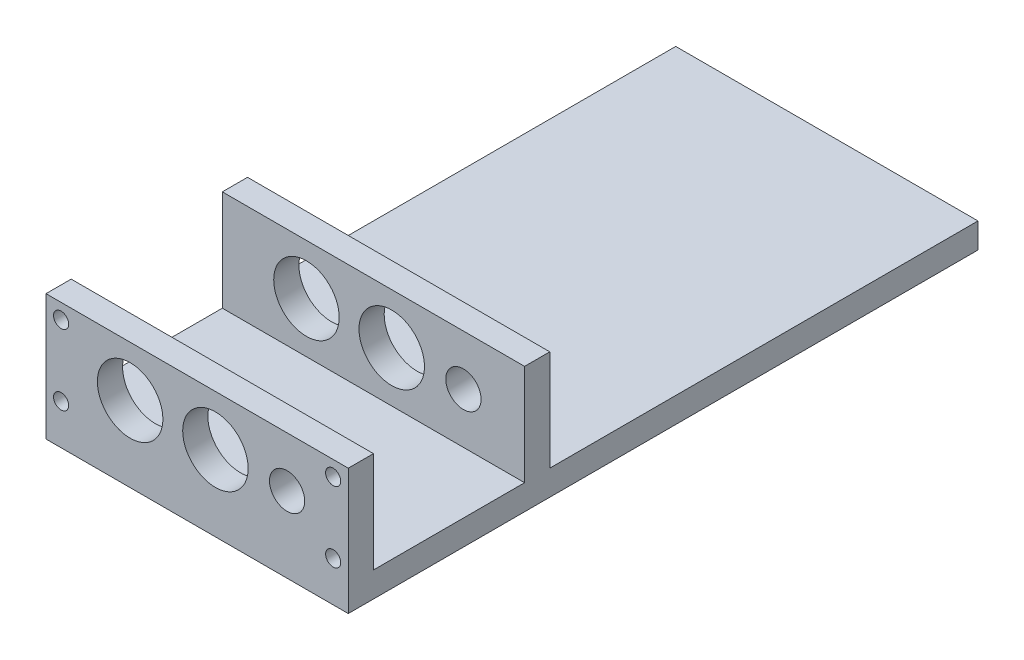
ISO-10303-21;
HEADER;
FILE_DESCRIPTION(('STEP AP214'),'2;1');
FILE_NAME('part.step','',(''),(''),'','','');
FILE_SCHEMA(('AUTOMOTIVE_DESIGN { 1 0 10303 214 1 1 1 1 }'));
ENDSEC;
DATA;
#1=APPLICATION_CONTEXT('core data for automotive mechanical design processes');
#2=APPLICATION_PROTOCOL_DEFINITION('international standard','automotive_design',2000,#1);
#3=PRODUCT_CONTEXT('',#1,'mechanical');
#4=PRODUCT('Part','Part','',(#3));
#5=PRODUCT_RELATED_PRODUCT_CATEGORY('part','',(#4));
#6=PRODUCT_DEFINITION_FORMATION('','',#4);
#7=PRODUCT_DEFINITION_CONTEXT('part definition',#1,'design');
#8=PRODUCT_DEFINITION('design','',#6,#7);
#9=PRODUCT_DEFINITION_SHAPE('','',#8);
#10=(LENGTH_UNIT() NAMED_UNIT(*) SI_UNIT(.MILLI.,.METRE.));
#11=(NAMED_UNIT(*) PLANE_ANGLE_UNIT() SI_UNIT($,.RADIAN.));
#12=(NAMED_UNIT(*) SI_UNIT($,.STERADIAN.) SOLID_ANGLE_UNIT());
#13=UNCERTAINTY_MEASURE_WITH_UNIT(LENGTH_MEASURE(1.E-05),#10,'distance_accuracy_value','');
#14=(GEOMETRIC_REPRESENTATION_CONTEXT(3) GLOBAL_UNCERTAINTY_ASSIGNED_CONTEXT((#13)) GLOBAL_UNIT_ASSIGNED_CONTEXT((#10,
#11,#12)) REPRESENTATION_CONTEXT('',''));
#15=CARTESIAN_POINT('',(0.,0.,0.));
#16=DIRECTION('',(0.,0.,1.));
#17=DIRECTION('',(1.,0.,0.));
#18=AXIS2_PLACEMENT_3D('',#15,#16,#17);
#19=CARTESIAN_POINT('',(60.,5.,-120.));
#20=DIRECTION('',(0.,-1.,0.));
#21=DIRECTION('',(0.,0.,-1.));
#22=AXIS2_PLACEMENT_3D('',#19,#20,#21);
#23=PLANE('',#22);
#24=DIRECTION('',(-1.,0.,0.));
#25=VECTOR('',#24,1.);
#26=CARTESIAN_POINT('',(60.,5.,-35.));
#27=LINE('',#26,#25);
#28=CARTESIAN_POINT('',(60.,5.,-35.));
#29=VERTEX_POINT('',#28);
#30=CARTESIAN_POINT('',(0.,5.,-35.));
#31=VERTEX_POINT('',#30);
#32=EDGE_CURVE('E230',#29,#31,#27,.T.);
#33=ORIENTED_EDGE('',*,*,#32,.F.);
#34=DIRECTION('',(0.,0.,1.));
#35=VECTOR('',#34,1.);
#36=CARTESIAN_POINT('',(60.,5.,-120.));
#37=LINE('',#36,#35);
#38=CARTESIAN_POINT('',(60.,5.,-120.));
#39=VERTEX_POINT('',#38);
#40=EDGE_CURVE('E138',#39,#29,#37,.T.);
#41=ORIENTED_EDGE('',*,*,#40,.F.);
#42=DIRECTION('',(1.,0.,0.));
#43=VECTOR('',#42,1.);
#44=CARTESIAN_POINT('',(60.,5.,-120.));
#45=LINE('',#44,#43);
#46=CARTESIAN_POINT('',(0.,5.,-120.));
#47=VERTEX_POINT('',#46);
#48=EDGE_CURVE('E155',#47,#39,#45,.T.);
#49=ORIENTED_EDGE('',*,*,#48,.F.);
#50=DIRECTION('',(0.,0.,1.));
#51=VECTOR('',#50,1.);
#52=CARTESIAN_POINT('',(0.,5.,-120.));
#53=LINE('',#52,#51);
#54=EDGE_CURVE('E60',#47,#31,#53,.T.);
#55=ORIENTED_EDGE('',*,*,#54,.T.);
#56=EDGE_LOOP('',(#33,#41,#49,#55));
#57=FACE_BOUND('',#56,.T.);
#58=ADVANCED_FACE('F35',(#57),#23,.F.);
#59=DIRECTION('',(1.,0.,0.));
#60=VECTOR('',#59,1.);
#61=CARTESIAN_POINT('',(0.,5.,-30.));
#62=LINE('',#61,#60);
#63=CARTESIAN_POINT('',(0.,5.,-30.));
#64=VERTEX_POINT('',#63);
#65=CARTESIAN_POINT('',(60.,5.,-30.));
#66=VERTEX_POINT('',#65);
#67=EDGE_CURVE('E52',#64,#66,#62,.T.);
#68=ORIENTED_EDGE('',*,*,#67,.F.);
#69=CARTESIAN_POINT('',(0.,5.,0.));
#70=VERTEX_POINT('',#69);
#71=EDGE_CURVE('E159',#64,#70,#53,.T.);
#72=ORIENTED_EDGE('',*,*,#71,.T.);
#73=DIRECTION('',(1.,0.,0.));
#74=VECTOR('',#73,1.);
#75=CARTESIAN_POINT('',(60.,5.,0.));
#76=LINE('',#75,#74);
#77=CARTESIAN_POINT('',(60.,5.,0.));
#78=VERTEX_POINT('',#77);
#79=EDGE_CURVE('E139',#70,#78,#76,.T.);
#80=ORIENTED_EDGE('',*,*,#79,.T.);
#81=EDGE_CURVE('E156',#66,#78,#37,.T.);
#82=ORIENTED_EDGE('',*,*,#81,.F.);
#83=EDGE_LOOP('',(#68,#72,#80,#82));
#84=FACE_BOUND('',#83,.T.);
#85=ADVANCED_FACE('F244',(#84),#23,.F.);
#86=CARTESIAN_POINT('',(0.,0.,5.));
#87=DIRECTION('',(1.,0.,0.));
#88=DIRECTION('',(0.,0.,-1.));
#89=AXIS2_PLACEMENT_3D('',#86,#87,#88);
#90=PLANE('',#89);
#91=DIRECTION('',(0.,-1.,0.));
#92=VECTOR('',#91,1.);
#93=CARTESIAN_POINT('',(0.,0.,0.));
#94=LINE('',#93,#92);
#95=CARTESIAN_POINT('',(0.,25.,0.));
#96=VERTEX_POINT('',#95);
#97=EDGE_CURVE('E161',#96,#70,#94,.T.);
#98=ORIENTED_EDGE('',*,*,#97,.T.);
#99=ORIENTED_EDGE('',*,*,#71,.F.);
#100=DIRECTION('',(0.,-1.,0.));
#101=VECTOR('',#100,1.);
#102=CARTESIAN_POINT('',(0.,25.,-30.));
#103=LINE('',#102,#101);
#104=CARTESIAN_POINT('',(0.,25.,-30.));
#105=VERTEX_POINT('',#104);
#106=EDGE_CURVE('E144',#105,#64,#103,.T.);
#107=ORIENTED_EDGE('',*,*,#106,.F.);
#108=DIRECTION('',(0.,0.,1.));
#109=VECTOR('',#108,1.);
#110=CARTESIAN_POINT('',(0.,25.,-35.));
#111=LINE('',#110,#109);
#112=CARTESIAN_POINT('',(0.,25.,-35.));
#113=VERTEX_POINT('',#112);
#114=EDGE_CURVE('E123',#113,#105,#111,.T.);
#115=ORIENTED_EDGE('',*,*,#114,.F.);
#116=DIRECTION('',(0.,-1.,0.));
#117=VECTOR('',#116,1.);
#118=CARTESIAN_POINT('',(0.,25.,-35.));
#119=LINE('',#118,#117);
#120=EDGE_CURVE('E120',#113,#31,#119,.T.);
#121=ORIENTED_EDGE('',*,*,#120,.T.);
#122=ORIENTED_EDGE('',*,*,#54,.F.);
#123=DIRECTION('',(0.,1.,0.));
#124=VECTOR('',#123,1.);
#125=CARTESIAN_POINT('',(0.,5.,-120.));
#126=LINE('',#125,#124);
#127=CARTESIAN_POINT('',(0.,0.,-120.));
#128=VERTEX_POINT('',#127);
#129=EDGE_CURVE('E153',#128,#47,#126,.T.);
#130=ORIENTED_EDGE('',*,*,#129,.F.);
#131=DIRECTION('',(0.,0.,-1.));
#132=VECTOR('',#131,1.);
#133=CARTESIAN_POINT('',(0.,0.,5.));
#134=LINE('',#133,#132);
#135=CARTESIAN_POINT('',(0.,0.,5.));
#136=VERTEX_POINT('',#135);
#137=EDGE_CURVE('E11',#136,#128,#134,.T.);
#138=ORIENTED_EDGE('',*,*,#137,.F.);
#139=DIRECTION('',(0.,-1.,0.));
#140=VECTOR('',#139,1.);
#141=CARTESIAN_POINT('',(0.,0.,5.));
#142=LINE('',#141,#140);
#143=CARTESIAN_POINT('',(0.,25.,5.));
#144=VERTEX_POINT('',#143);
#145=EDGE_CURVE('E162',#144,#136,#142,.T.);
#146=ORIENTED_EDGE('',*,*,#145,.F.);
#147=DIRECTION('',(0.,0.,-1.));
#148=VECTOR('',#147,1.);
#149=CARTESIAN_POINT('',(0.,25.,5.));
#150=LINE('',#149,#148);
#151=EDGE_CURVE('E172',#144,#96,#150,.T.);
#152=ORIENTED_EDGE('',*,*,#151,.T.);
#153=EDGE_LOOP('',(#98,#99,#107,#115,#121,#122,#130,#138,#146,#152));
#154=FACE_BOUND('',#153,.T.);
#155=ADVANCED_FACE('F37',(#154),#90,.F.);
#156=CARTESIAN_POINT('',(0.,0.,5.));
#157=DIRECTION('',(0.,1.,0.));
#158=DIRECTION('',(0.,0.,1.));
#159=AXIS2_PLACEMENT_3D('',#156,#157,#158);
#160=PLANE('',#159);
#161=ORIENTED_EDGE('',*,*,#137,.T.);
#162=DIRECTION('',(-1.,0.,0.));
#163=VECTOR('',#162,1.);
#164=CARTESIAN_POINT('',(60.,0.,-120.));
#165=LINE('',#164,#163);
#166=CARTESIAN_POINT('',(60.,0.,-120.));
#167=VERTEX_POINT('',#166);
#168=EDGE_CURVE('E150',#167,#128,#165,.T.);
#169=ORIENTED_EDGE('',*,*,#168,.F.);
#170=DIRECTION('',(0.,0.,-1.));
#171=VECTOR('',#170,1.);
#172=CARTESIAN_POINT('',(60.,0.,5.));
#173=LINE('',#172,#171);
#174=CARTESIAN_POINT('',(60.,0.,5.));
#175=VERTEX_POINT('',#174);
#176=EDGE_CURVE('E44',#175,#167,#173,.T.);
#177=ORIENTED_EDGE('',*,*,#176,.F.);
#178=DIRECTION('',(1.,0.,0.));
#179=VECTOR('',#178,1.);
#180=CARTESIAN_POINT('',(0.,0.,5.));
#181=LINE('',#180,#179);
#182=EDGE_CURVE('E165',#136,#175,#181,.T.);
#183=ORIENTED_EDGE('',*,*,#182,.F.);
#184=EDGE_LOOP('',(#161,#169,#177,#183));
#185=FACE_BOUND('',#184,.T.);
#186=ADVANCED_FACE('F262',(#185),#160,.F.);
#187=CARTESIAN_POINT('',(60.,0.,5.));
#188=DIRECTION('',(-1.,0.,0.));
#189=DIRECTION('',(0.,0.,1.));
#190=AXIS2_PLACEMENT_3D('',#187,#188,#189);
#191=PLANE('',#190);
#192=ORIENTED_EDGE('',*,*,#176,.T.);
#193=DIRECTION('',(0.,-1.,0.));
#194=VECTOR('',#193,1.);
#195=CARTESIAN_POINT('',(60.,5.,-120.));
#196=LINE('',#195,#194);
#197=EDGE_CURVE('E142',#39,#167,#196,.T.);
#198=ORIENTED_EDGE('',*,*,#197,.F.);
#199=ORIENTED_EDGE('',*,*,#40,.T.);
#200=DIRECTION('',(0.,-1.,0.));
#201=VECTOR('',#200,1.);
#202=CARTESIAN_POINT('',(60.,25.,-35.));
#203=LINE('',#202,#201);
#204=CARTESIAN_POINT('',(60.,25.,-35.));
#205=VERTEX_POINT('',#204);
#206=EDGE_CURVE('E118',#205,#29,#203,.T.);
#207=ORIENTED_EDGE('',*,*,#206,.F.);
#208=DIRECTION('',(0.,0.,-1.));
#209=VECTOR('',#208,1.);
#210=CARTESIAN_POINT('',(60.,25.,-30.));
#211=LINE('',#210,#209);
#212=CARTESIAN_POINT('',(60.,25.,-30.));
#213=VERTEX_POINT('',#212);
#214=EDGE_CURVE('E124',#213,#205,#211,.T.);
#215=ORIENTED_EDGE('',*,*,#214,.F.);
#216=DIRECTION('',(0.,-1.,0.));
#217=VECTOR('',#216,1.);
#218=CARTESIAN_POINT('',(60.,25.,-30.));
#219=LINE('',#218,#217);
#220=EDGE_CURVE('E234',#213,#66,#219,.T.);
#221=ORIENTED_EDGE('',*,*,#220,.T.);
#222=ORIENTED_EDGE('',*,*,#81,.T.);
#223=DIRECTION('',(0.,1.,0.));
#224=VECTOR('',#223,1.);
#225=CARTESIAN_POINT('',(60.,0.,0.));
#226=LINE('',#225,#224);
#227=CARTESIAN_POINT('',(60.,25.,0.));
#228=VERTEX_POINT('',#227);
#229=EDGE_CURVE('E175',#78,#228,#226,.T.);
#230=ORIENTED_EDGE('',*,*,#229,.T.);
#231=DIRECTION('',(0.,0.,-1.));
#232=VECTOR('',#231,1.);
#233=CARTESIAN_POINT('',(60.,25.,5.));
#234=LINE('',#233,#232);
#235=CARTESIAN_POINT('',(60.,25.,5.));
#236=VERTEX_POINT('',#235);
#237=EDGE_CURVE('E180',#236,#228,#234,.T.);
#238=ORIENTED_EDGE('',*,*,#237,.F.);
#239=DIRECTION('',(0.,1.,0.));
#240=VECTOR('',#239,1.);
#241=CARTESIAN_POINT('',(60.,0.,5.));
#242=LINE('',#241,#240);
#243=EDGE_CURVE('E168',#175,#236,#242,.T.);
#244=ORIENTED_EDGE('',*,*,#243,.F.);
#245=EDGE_LOOP('',(#192,#198,#199,#207,#215,#221,#222,#230,#238,#244));
#246=FACE_BOUND('',#245,.T.);
#247=ADVANCED_FACE('F135',(#246),#191,.F.);
#248=CARTESIAN_POINT('',(0.,25.,5.));
#249=DIRECTION('',(0.,-1.,0.));
#250=DIRECTION('',(0.,0.,-1.));
#251=AXIS2_PLACEMENT_3D('',#248,#249,#250);
#252=PLANE('',#251);
#253=DIRECTION('',(-1.,0.,0.));
#254=VECTOR('',#253,1.);
#255=CARTESIAN_POINT('',(0.,25.,0.));
#256=LINE('',#255,#254);
#257=EDGE_CURVE('E166',#228,#96,#256,.T.);
#258=ORIENTED_EDGE('',*,*,#257,.T.);
#259=ORIENTED_EDGE('',*,*,#151,.F.);
#260=DIRECTION('',(-1.,0.,0.));
#261=VECTOR('',#260,1.);
#262=CARTESIAN_POINT('',(0.,25.,5.));
#263=LINE('',#262,#261);
#264=EDGE_CURVE('E170',#236,#144,#263,.T.);
#265=ORIENTED_EDGE('',*,*,#264,.F.);
#266=ORIENTED_EDGE('',*,*,#237,.T.);
#267=EDGE_LOOP('',(#258,#259,#265,#266));
#268=FACE_BOUND('',#267,.T.);
#269=ADVANCED_FACE('F253',(#268),#252,.F.);
#270=CARTESIAN_POINT('',(0.,0.,5.));
#271=DIRECTION('',(0.,0.,-1.));
#272=DIRECTION('',(-1.,0.,0.));
#273=AXIS2_PLACEMENT_3D('',#270,#271,#272);
#274=PLANE('',#273);
#275=CARTESIAN_POINT('',(47.8557825484138,15.,5.));
#276=DIRECTION('',(0.,0.,-1.));
#277=DIRECTION('',(-1.,0.,0.));
#278=AXIS2_PLACEMENT_3D('',#275,#276,#277);
#279=CIRCLE('',#278,3.5);
#280=CARTESIAN_POINT('',(44.3557825484138,15.,5.));
#281=VERTEX_POINT('',#280);
#282=EDGE_CURVE('E515',#281,#281,#279,.T.);
#283=ORIENTED_EDGE('',*,*,#282,.T.);
#284=EDGE_LOOP('',(#283));
#285=FACE_BOUND('',#284,.T.);
#286=CARTESIAN_POINT('',(33.6293932202949,15.,5.));
#287=DIRECTION('',(0.,0.,-1.));
#288=DIRECTION('',(-1.,0.,0.));
#289=AXIS2_PLACEMENT_3D('',#286,#287,#288);
#290=CIRCLE('',#289,6.5);
#291=CARTESIAN_POINT('',(27.1293932202949,15.,5.));
#292=VERTEX_POINT('',#291);
#293=EDGE_CURVE('E187',#292,#292,#290,.T.);
#294=ORIENTED_EDGE('',*,*,#293,.T.);
#295=EDGE_LOOP('',(#294));
#296=FACE_BOUND('',#295,.T.);
#297=CARTESIAN_POINT('',(16.6993728410354,15.,5.));
#298=DIRECTION('',(0.,0.,-1.));
#299=DIRECTION('',(-1.,0.,0.));
#300=AXIS2_PLACEMENT_3D('',#297,#298,#299);
#301=CIRCLE('',#300,6.5);
#302=CARTESIAN_POINT('',(10.1993728410354,15.,5.));
#303=VERTEX_POINT('',#302);
#304=EDGE_CURVE('E505',#303,#303,#301,.T.);
#305=ORIENTED_EDGE('',*,*,#304,.T.);
#306=EDGE_LOOP('',(#305));
#307=FACE_BOUND('',#306,.T.);
#308=CARTESIAN_POINT('',(57.,8.,5.));
#309=DIRECTION('',(0.,0.,-1.));
#310=DIRECTION('',(-1.,0.,0.));
#311=AXIS2_PLACEMENT_3D('',#308,#309,#310);
#312=CIRCLE('',#311,1.5);
#313=CARTESIAN_POINT('',(55.5,8.,5.));
#314=VERTEX_POINT('',#313);
#315=EDGE_CURVE('E228',#314,#314,#312,.T.);
#316=ORIENTED_EDGE('',*,*,#315,.T.);
#317=EDGE_LOOP('',(#316));
#318=FACE_BOUND('',#317,.T.);
#319=CARTESIAN_POINT('',(3.,22.,5.));
#320=DIRECTION('',(0.,0.,-1.));
#321=DIRECTION('',(-1.,0.,0.));
#322=AXIS2_PLACEMENT_3D('',#319,#320,#321);
#323=CIRCLE('',#322,1.5);
#324=CARTESIAN_POINT('',(1.50000000000001,22.,5.));
#325=VERTEX_POINT('',#324);
#326=EDGE_CURVE('E225',#325,#325,#323,.T.);
#327=ORIENTED_EDGE('',*,*,#326,.T.);
#328=EDGE_LOOP('',(#327));
#329=FACE_BOUND('',#328,.T.);
#330=CARTESIAN_POINT('',(3.,8.,5.));
#331=DIRECTION('',(0.,0.,-1.));
#332=DIRECTION('',(-1.,0.,0.));
#333=AXIS2_PLACEMENT_3D('',#330,#331,#332);
#334=CIRCLE('',#333,1.5);
#335=CARTESIAN_POINT('',(1.50000000000001,8.,5.));
#336=VERTEX_POINT('',#335);
#337=EDGE_CURVE('E222',#336,#336,#334,.T.);
#338=ORIENTED_EDGE('',*,*,#337,.T.);
#339=EDGE_LOOP('',(#338));
#340=FACE_BOUND('',#339,.T.);
#341=CARTESIAN_POINT('',(57.,22.,5.));
#342=DIRECTION('',(0.,0.,-1.));
#343=DIRECTION('',(-1.,0.,0.));
#344=AXIS2_PLACEMENT_3D('',#341,#342,#343);
#345=CIRCLE('',#344,1.5);
#346=CARTESIAN_POINT('',(55.5,22.,5.));
#347=VERTEX_POINT('',#346);
#348=EDGE_CURVE('E219',#347,#347,#345,.T.);
#349=ORIENTED_EDGE('',*,*,#348,.T.);
#350=EDGE_LOOP('',(#349));
#351=FACE_BOUND('',#350,.T.);
#352=ORIENTED_EDGE('',*,*,#145,.T.);
#353=ORIENTED_EDGE('',*,*,#182,.T.);
#354=ORIENTED_EDGE('',*,*,#243,.T.);
#355=ORIENTED_EDGE('',*,*,#264,.T.);
#356=EDGE_LOOP('',(#352,#353,#354,#355));
#357=FACE_BOUND('',#356,.T.);
#358=ADVANCED_FACE('F257',(#285,#296,#307,#318,#329,#340,#351,#357),#274,.F.);
#359=CARTESIAN_POINT('',(0.,0.,0.));
#360=DIRECTION('',(0.,0.,-1.));
#361=DIRECTION('',(-1.,0.,0.));
#362=AXIS2_PLACEMENT_3D('',#359,#360,#361);
#363=PLANE('',#362);
#364=CARTESIAN_POINT('',(47.8557825484138,15.,0.));
#365=DIRECTION('',(0.,0.,-1.));
#366=DIRECTION('',(-1.,0.,0.));
#367=AXIS2_PLACEMENT_3D('',#364,#365,#366);
#368=CIRCLE('',#367,3.5);
#369=CARTESIAN_POINT('',(44.3557825484138,15.,0.));
#370=VERTEX_POINT('',#369);
#371=EDGE_CURVE('E507',#370,#370,#368,.T.);
#372=ORIENTED_EDGE('',*,*,#371,.F.);
#373=EDGE_LOOP('',(#372));
#374=FACE_BOUND('',#373,.T.);
#375=CARTESIAN_POINT('',(33.6293932202949,15.,0.));
#376=DIRECTION('',(0.,0.,-1.));
#377=DIRECTION('',(-1.,0.,0.));
#378=AXIS2_PLACEMENT_3D('',#375,#376,#377);
#379=CIRCLE('',#378,6.5);
#380=CARTESIAN_POINT('',(27.1293932202949,15.,0.));
#381=VERTEX_POINT('',#380);
#382=EDGE_CURVE('E195',#381,#381,#379,.T.);
#383=ORIENTED_EDGE('',*,*,#382,.F.);
#384=EDGE_LOOP('',(#383));
#385=FACE_BOUND('',#384,.T.);
#386=CARTESIAN_POINT('',(16.6993728410354,15.,0.));
#387=DIRECTION('',(0.,0.,-1.));
#388=DIRECTION('',(-1.,0.,0.));
#389=AXIS2_PLACEMENT_3D('',#386,#387,#388);
#390=CIRCLE('',#389,6.5);
#391=CARTESIAN_POINT('',(10.1993728410354,15.,0.));
#392=VERTEX_POINT('',#391);
#393=EDGE_CURVE('E191',#392,#392,#390,.T.);
#394=ORIENTED_EDGE('',*,*,#393,.F.);
#395=EDGE_LOOP('',(#394));
#396=FACE_BOUND('',#395,.T.);
#397=CARTESIAN_POINT('',(57.,8.,0.));
#398=DIRECTION('',(0.,0.,-1.));
#399=DIRECTION('',(1.,0.,0.));
#400=AXIS2_PLACEMENT_3D('',#397,#398,#399);
#401=CIRCLE('',#400,1.5);
#402=CARTESIAN_POINT('',(58.5,8.,0.));
#403=VERTEX_POINT('',#402);
#404=EDGE_CURVE('E211',#403,#403,#401,.T.);
#405=ORIENTED_EDGE('',*,*,#404,.F.);
#406=EDGE_LOOP('',(#405));
#407=FACE_BOUND('',#406,.T.);
#408=CARTESIAN_POINT('',(3.,22.,0.));
#409=DIRECTION('',(0.,0.,-1.));
#410=DIRECTION('',(1.,0.,0.));
#411=AXIS2_PLACEMENT_3D('',#408,#409,#410);
#412=CIRCLE('',#411,1.5);
#413=CARTESIAN_POINT('',(4.5,22.,0.));
#414=VERTEX_POINT('',#413);
#415=EDGE_CURVE('E210',#414,#414,#412,.T.);
#416=ORIENTED_EDGE('',*,*,#415,.F.);
#417=EDGE_LOOP('',(#416));
#418=FACE_BOUND('',#417,.T.);
#419=CARTESIAN_POINT('',(3.,8.,0.));
#420=DIRECTION('',(0.,0.,-1.));
#421=DIRECTION('',(-1.,0.,0.));
#422=AXIS2_PLACEMENT_3D('',#419,#420,#421);
#423=CIRCLE('',#422,1.5);
#424=CARTESIAN_POINT('',(1.50000000000001,8.,0.));
#425=VERTEX_POINT('',#424);
#426=EDGE_CURVE('E207',#425,#425,#423,.T.);
#427=ORIENTED_EDGE('',*,*,#426,.F.);
#428=EDGE_LOOP('',(#427));
#429=FACE_BOUND('',#428,.T.);
#430=CARTESIAN_POINT('',(57.,22.,0.));
#431=DIRECTION('',(0.,0.,-1.));
#432=DIRECTION('',(-1.,0.,0.));
#433=AXIS2_PLACEMENT_3D('',#430,#431,#432);
#434=CIRCLE('',#433,1.5);
#435=CARTESIAN_POINT('',(55.5,22.,0.));
#436=VERTEX_POINT('',#435);
#437=EDGE_CURVE('E214',#436,#436,#434,.T.);
#438=ORIENTED_EDGE('',*,*,#437,.F.);
#439=EDGE_LOOP('',(#438));
#440=FACE_BOUND('',#439,.T.);
#441=ORIENTED_EDGE('',*,*,#79,.F.);
#442=ORIENTED_EDGE('',*,*,#97,.F.);
#443=ORIENTED_EDGE('',*,*,#257,.F.);
#444=ORIENTED_EDGE('',*,*,#229,.F.);
#445=EDGE_LOOP('',(#441,#442,#443,#444));
#446=FACE_BOUND('',#445,.T.);
#447=ADVANCED_FACE('F247',(#374,#385,#396,#407,#418,#429,#440,#446),#363,.T.);
#448=CARTESIAN_POINT('',(0.,0.,-120.));
#449=DIRECTION('',(0.,0.,-1.));
#450=DIRECTION('',(-1.,0.,0.));
#451=AXIS2_PLACEMENT_3D('',#448,#449,#450);
#452=PLANE('',#451);
#453=ORIENTED_EDGE('',*,*,#197,.T.);
#454=ORIENTED_EDGE('',*,*,#168,.T.);
#455=ORIENTED_EDGE('',*,*,#129,.T.);
#456=ORIENTED_EDGE('',*,*,#48,.T.);
#457=EDGE_LOOP('',(#453,#454,#455,#456));
#458=FACE_BOUND('',#457,.T.);
#459=ADVANCED_FACE('F265',(#458),#452,.T.);
#460=CARTESIAN_POINT('',(60.,25.,-35.));
#461=DIRECTION('',(0.,0.,1.));
#462=DIRECTION('',(1.,0.,0.));
#463=AXIS2_PLACEMENT_3D('',#460,#461,#462);
#464=PLANE('',#463);
#465=CARTESIAN_POINT('',(47.8557825484138,15.,-35.));
#466=DIRECTION('',(0.,0.,1.));
#467=DIRECTION('',(1.,0.,0.));
#468=AXIS2_PLACEMENT_3D('',#465,#466,#467);
#469=CIRCLE('',#468,3.5);
#470=CARTESIAN_POINT('',(51.3557825484138,15.,-35.));
#471=VERTEX_POINT('',#470);
#472=EDGE_CURVE('E510',#471,#471,#469,.T.);
#473=ORIENTED_EDGE('',*,*,#472,.T.);
#474=EDGE_LOOP('',(#473));
#475=FACE_BOUND('',#474,.T.);
#476=CARTESIAN_POINT('',(33.6293932202949,15.,-35.));
#477=DIRECTION('',(0.,0.,1.));
#478=DIRECTION('',(1.,0.,0.));
#479=AXIS2_PLACEMENT_3D('',#476,#477,#478);
#480=CIRCLE('',#479,6.5);
#481=CARTESIAN_POINT('',(40.1293932202949,15.,-35.));
#482=VERTEX_POINT('',#481);
#483=EDGE_CURVE('E190',#482,#482,#480,.T.);
#484=ORIENTED_EDGE('',*,*,#483,.T.);
#485=EDGE_LOOP('',(#484));
#486=FACE_BOUND('',#485,.T.);
#487=CARTESIAN_POINT('',(16.6993728410354,15.,-35.));
#488=DIRECTION('',(0.,0.,1.));
#489=DIRECTION('',(1.,0.,0.));
#490=AXIS2_PLACEMENT_3D('',#487,#488,#489);
#491=CIRCLE('',#490,6.5);
#492=CARTESIAN_POINT('',(23.1993728410354,15.,-35.));
#493=VERTEX_POINT('',#492);
#494=EDGE_CURVE('E186',#493,#493,#491,.T.);
#495=ORIENTED_EDGE('',*,*,#494,.T.);
#496=EDGE_LOOP('',(#495));
#497=FACE_BOUND('',#496,.T.);
#498=ORIENTED_EDGE('',*,*,#32,.T.);
#499=ORIENTED_EDGE('',*,*,#120,.F.);
#500=DIRECTION('',(-1.,0.,0.));
#501=VECTOR('',#500,1.);
#502=CARTESIAN_POINT('',(60.,25.,-35.));
#503=LINE('',#502,#501);
#504=EDGE_CURVE('E114',#205,#113,#503,.T.);
#505=ORIENTED_EDGE('',*,*,#504,.F.);
#506=ORIENTED_EDGE('',*,*,#206,.T.);
#507=EDGE_LOOP('',(#498,#499,#505,#506));
#508=FACE_BOUND('',#507,.T.);
#509=ADVANCED_FACE('F116',(#475,#486,#497,#508),#464,.F.);
#510=CARTESIAN_POINT('',(0.,25.,-30.));
#511=DIRECTION('',(0.,0.,-1.));
#512=DIRECTION('',(-1.,0.,0.));
#513=AXIS2_PLACEMENT_3D('',#510,#511,#512);
#514=PLANE('',#513);
#515=CARTESIAN_POINT('',(47.8557825484138,15.,-30.));
#516=DIRECTION('',(0.,0.,-1.));
#517=DIRECTION('',(-1.,0.,0.));
#518=AXIS2_PLACEMENT_3D('',#515,#516,#517);
#519=CIRCLE('',#518,3.5);
#520=CARTESIAN_POINT('',(44.3557825484138,15.,-30.));
#521=VERTEX_POINT('',#520);
#522=EDGE_CURVE('E39',#521,#521,#519,.T.);
#523=ORIENTED_EDGE('',*,*,#522,.T.);
#524=EDGE_LOOP('',(#523));
#525=FACE_BOUND('',#524,.T.);
#526=CARTESIAN_POINT('',(33.6293932202949,15.,-30.));
#527=DIRECTION('',(0.,0.,-1.));
#528=DIRECTION('',(-1.,0.,0.));
#529=AXIS2_PLACEMENT_3D('',#526,#527,#528);
#530=CIRCLE('',#529,6.5);
#531=CARTESIAN_POINT('',(27.1293932202949,15.,-30.));
#532=VERTEX_POINT('',#531);
#533=EDGE_CURVE('E188',#532,#532,#530,.T.);
#534=ORIENTED_EDGE('',*,*,#533,.T.);
#535=EDGE_LOOP('',(#534));
#536=FACE_BOUND('',#535,.T.);
#537=CARTESIAN_POINT('',(16.6993728410354,15.,-30.));
#538=DIRECTION('',(0.,0.,-1.));
#539=DIRECTION('',(-1.,0.,0.));
#540=AXIS2_PLACEMENT_3D('',#537,#538,#539);
#541=CIRCLE('',#540,6.5);
#542=CARTESIAN_POINT('',(10.1993728410354,15.,-30.));
#543=VERTEX_POINT('',#542);
#544=EDGE_CURVE('E184',#543,#543,#541,.T.);
#545=ORIENTED_EDGE('',*,*,#544,.T.);
#546=EDGE_LOOP('',(#545));
#547=FACE_BOUND('',#546,.T.);
#548=ORIENTED_EDGE('',*,*,#67,.T.);
#549=ORIENTED_EDGE('',*,*,#220,.F.);
#550=DIRECTION('',(1.,0.,0.));
#551=VECTOR('',#550,1.);
#552=CARTESIAN_POINT('',(0.,25.,-30.));
#553=LINE('',#552,#551);
#554=EDGE_CURVE('E129',#105,#213,#553,.T.);
#555=ORIENTED_EDGE('',*,*,#554,.F.);
#556=ORIENTED_EDGE('',*,*,#106,.T.);
#557=EDGE_LOOP('',(#548,#549,#555,#556));
#558=FACE_BOUND('',#557,.T.);
#559=ADVANCED_FACE('F240',(#525,#536,#547,#558),#514,.F.);
#560=CARTESIAN_POINT('',(0.,25.,0.));
#561=DIRECTION('',(0.,1.,0.));
#562=DIRECTION('',(0.,0.,1.));
#563=AXIS2_PLACEMENT_3D('',#560,#561,#562);
#564=PLANE('',#563);
#565=ORIENTED_EDGE('',*,*,#214,.T.);
#566=ORIENTED_EDGE('',*,*,#504,.T.);
#567=ORIENTED_EDGE('',*,*,#114,.T.);
#568=ORIENTED_EDGE('',*,*,#554,.T.);
#569=EDGE_LOOP('',(#565,#566,#567,#568));
#570=FACE_BOUND('',#569,.T.);
#571=ADVANCED_FACE('F127',(#570),#564,.T.);
#572=CARTESIAN_POINT('',(57.,22.,20.));
#573=DIRECTION('',(0.,0.,-1.));
#574=DIRECTION('',(-1.,0.,0.));
#575=AXIS2_PLACEMENT_3D('',#572,#573,#574);
#576=CYLINDRICAL_SURFACE('',#575,1.5);
#577=ORIENTED_EDGE('',*,*,#437,.T.);
#578=EDGE_LOOP('',(#577));
#579=FACE_BOUND('',#578,.T.);
#580=ORIENTED_EDGE('',*,*,#348,.F.);
#581=EDGE_LOOP('',(#580));
#582=FACE_BOUND('',#581,.T.);
#583=ADVANCED_FACE('F391',(#579,#582),#576,.F.);
#584=CARTESIAN_POINT('',(3.,8.,20.));
#585=DIRECTION('',(0.,0.,-1.));
#586=DIRECTION('',(-1.,0.,0.));
#587=AXIS2_PLACEMENT_3D('',#584,#585,#586);
#588=CYLINDRICAL_SURFACE('',#587,1.5);
#589=ORIENTED_EDGE('',*,*,#426,.T.);
#590=EDGE_LOOP('',(#589));
#591=FACE_BOUND('',#590,.T.);
#592=ORIENTED_EDGE('',*,*,#337,.F.);
#593=EDGE_LOOP('',(#592));
#594=FACE_BOUND('',#593,.T.);
#595=ADVANCED_FACE('F387',(#591,#594),#588,.F.);
#596=CARTESIAN_POINT('',(3.,22.,20.));
#597=DIRECTION('',(0.,0.,-1.));
#598=DIRECTION('',(-1.,0.,0.));
#599=AXIS2_PLACEMENT_3D('',#596,#597,#598);
#600=CYLINDRICAL_SURFACE('',#599,1.5);
#601=ORIENTED_EDGE('',*,*,#415,.T.);
#602=EDGE_LOOP('',(#601));
#603=FACE_BOUND('',#602,.T.);
#604=ORIENTED_EDGE('',*,*,#326,.F.);
#605=EDGE_LOOP('',(#604));
#606=FACE_BOUND('',#605,.T.);
#607=ADVANCED_FACE('F390',(#603,#606),#600,.F.);
#608=CARTESIAN_POINT('',(57.,8.,20.));
#609=DIRECTION('',(0.,0.,-1.));
#610=DIRECTION('',(-1.,0.,0.));
#611=AXIS2_PLACEMENT_3D('',#608,#609,#610);
#612=CYLINDRICAL_SURFACE('',#611,1.5);
#613=ORIENTED_EDGE('',*,*,#404,.T.);
#614=EDGE_LOOP('',(#613));
#615=FACE_BOUND('',#614,.T.);
#616=ORIENTED_EDGE('',*,*,#315,.F.);
#617=EDGE_LOOP('',(#616));
#618=FACE_BOUND('',#617,.T.);
#619=ADVANCED_FACE('F393',(#615,#618),#612,.F.);
#620=CARTESIAN_POINT('',(16.6993728410354,15.,5.));
#621=DIRECTION('',(0.,0.,-1.));
#622=DIRECTION('',(-1.,0.,0.));
#623=AXIS2_PLACEMENT_3D('',#620,#621,#622);
#624=CYLINDRICAL_SURFACE('',#623,6.5);
#625=ORIENTED_EDGE('',*,*,#544,.F.);
#626=EDGE_LOOP('',(#625));
#627=FACE_BOUND('',#626,.T.);
#628=ORIENTED_EDGE('',*,*,#494,.F.);
#629=EDGE_LOOP('',(#628));
#630=FACE_BOUND('',#629,.T.);
#631=ADVANCED_FACE('F386',(#627,#630),#624,.F.);
#632=CARTESIAN_POINT('',(33.6293932202949,15.,5.));
#633=DIRECTION('',(0.,0.,-1.));
#634=DIRECTION('',(-1.,0.,0.));
#635=AXIS2_PLACEMENT_3D('',#632,#633,#634);
#636=CYLINDRICAL_SURFACE('',#635,6.5);
#637=ORIENTED_EDGE('',*,*,#533,.F.);
#638=EDGE_LOOP('',(#637));
#639=FACE_BOUND('',#638,.T.);
#640=ORIENTED_EDGE('',*,*,#483,.F.);
#641=EDGE_LOOP('',(#640));
#642=FACE_BOUND('',#641,.T.);
#643=ADVANCED_FACE('F383',(#639,#642),#636,.F.);
#644=ORIENTED_EDGE('',*,*,#393,.T.);
#645=EDGE_LOOP('',(#644));
#646=FACE_BOUND('',#645,.T.);
#647=ORIENTED_EDGE('',*,*,#304,.F.);
#648=EDGE_LOOP('',(#647));
#649=FACE_BOUND('',#648,.T.);
#650=ADVANCED_FACE('F381',(#646,#649),#624,.F.);
#651=ORIENTED_EDGE('',*,*,#382,.T.);
#652=EDGE_LOOP('',(#651));
#653=FACE_BOUND('',#652,.T.);
#654=ORIENTED_EDGE('',*,*,#293,.F.);
#655=EDGE_LOOP('',(#654));
#656=FACE_BOUND('',#655,.T.);
#657=ADVANCED_FACE('F362',(#653,#656),#636,.F.);
#658=CARTESIAN_POINT('',(47.8557825484138,15.,5.));
#659=DIRECTION('',(0.,0.,-1.));
#660=DIRECTION('',(-1.,0.,0.));
#661=AXIS2_PLACEMENT_3D('',#658,#659,#660);
#662=CYLINDRICAL_SURFACE('',#661,3.5);
#663=ORIENTED_EDGE('',*,*,#522,.F.);
#664=EDGE_LOOP('',(#663));
#665=FACE_BOUND('',#664,.T.);
#666=ORIENTED_EDGE('',*,*,#472,.F.);
#667=EDGE_LOOP('',(#666));
#668=FACE_BOUND('',#667,.T.);
#669=ADVANCED_FACE('F356',(#665,#668),#662,.F.);
#670=ORIENTED_EDGE('',*,*,#371,.T.);
#671=EDGE_LOOP('',(#670));
#672=FACE_BOUND('',#671,.T.);
#673=ORIENTED_EDGE('',*,*,#282,.F.);
#674=EDGE_LOOP('',(#673));
#675=FACE_BOUND('',#674,.T.);
#676=ADVANCED_FACE('F361',(#672,#675),#662,.F.);
#677=CLOSED_SHELL('',(#58,#85,#155,#186,#247,#269,#358,#447,#459,#509,#559,#571,#583,#595,#607,
#619,#631,#643,#650,#657,#669,#676));
#678=MANIFOLD_SOLID_BREP('B2',#677);
#679=ADVANCED_BREP_SHAPE_REPRESENTATION('',(#18,#678),#14);
#680=SHAPE_DEFINITION_REPRESENTATION(#9,#679);
ENDSEC;
END-ISO-10303-21;
